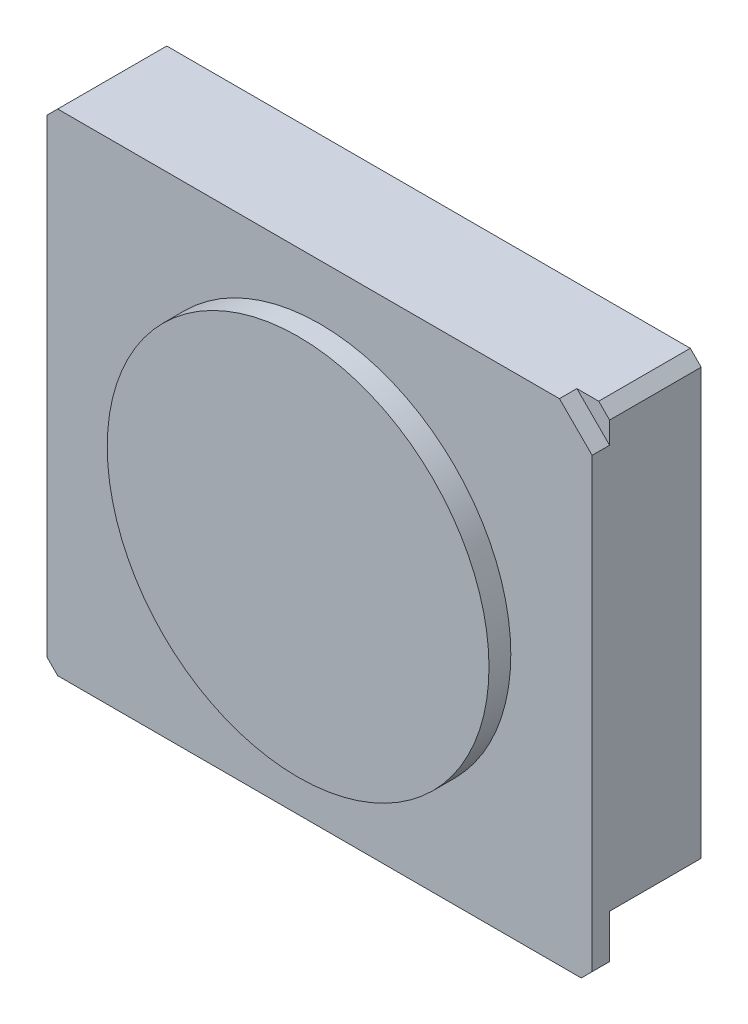
ISO-10303-21;
HEADER;
FILE_DESCRIPTION(('STEP AP214'),'2;1');
FILE_NAME('part.step','',(''),(''),'','','');
FILE_SCHEMA(('AUTOMOTIVE_DESIGN { 1 0 10303 214 1 1 1 1 }'));
ENDSEC;
DATA;
#1=APPLICATION_CONTEXT('core data for automotive mechanical design processes');
#2=APPLICATION_PROTOCOL_DEFINITION('international standard','automotive_design',2000,#1);
#3=PRODUCT_CONTEXT('',#1,'mechanical');
#4=PRODUCT('Part','Part','',(#3));
#5=PRODUCT_RELATED_PRODUCT_CATEGORY('part','',(#4));
#6=PRODUCT_DEFINITION_FORMATION('','',#4);
#7=PRODUCT_DEFINITION_CONTEXT('part definition',#1,'design');
#8=PRODUCT_DEFINITION('design','',#6,#7);
#9=PRODUCT_DEFINITION_SHAPE('','',#8);
#10=(LENGTH_UNIT() NAMED_UNIT(*) SI_UNIT(.MILLI.,.METRE.));
#11=(NAMED_UNIT(*) PLANE_ANGLE_UNIT() SI_UNIT($,.RADIAN.));
#12=(NAMED_UNIT(*) SI_UNIT($,.STERADIAN.) SOLID_ANGLE_UNIT());
#13=UNCERTAINTY_MEASURE_WITH_UNIT(LENGTH_MEASURE(1.E-05),#10,'distance_accuracy_value','');
#14=(GEOMETRIC_REPRESENTATION_CONTEXT(3) GLOBAL_UNCERTAINTY_ASSIGNED_CONTEXT((#13)) GLOBAL_UNIT_ASSIGNED_CONTEXT((#10,
#11,#12)) REPRESENTATION_CONTEXT('',''));
#15=CARTESIAN_POINT('',(0.,0.,0.));
#16=DIRECTION('',(0.,0.,1.));
#17=DIRECTION('',(1.,0.,0.));
#18=AXIS2_PLACEMENT_3D('',#15,#16,#17);
#19=CARTESIAN_POINT('',(0.,0.,-1.6));
#20=DIRECTION('',(0.,0.,-1.));
#21=DIRECTION('',(-1.,0.,0.));
#22=AXIS2_PLACEMENT_3D('',#19,#20,#21);
#23=PLANE('',#22);
#24=DIRECTION('',(0.,1.,0.));
#25=VECTOR('',#24,1.);
#26=CARTESIAN_POINT('',(24.9569707401033,-22.4612736660929,-1.6));
#27=LINE('',#26,#25);
#28=CARTESIAN_POINT('',(24.9569707401033,-21.4612736660929,-1.6));
#29=VERTEX_POINT('',#28);
#30=CARTESIAN_POINT('',(24.9569707401033,-17.4612736660929,-1.6));
#31=VERTEX_POINT('',#30);
#32=EDGE_CURVE('E320',#29,#31,#27,.T.);
#33=ORIENTED_EDGE('',*,*,#32,.F.);
#34=DIRECTION('',(0.707106781186545,0.70710678118655,0.));
#35=VECTOR('',#34,1.);
#36=CARTESIAN_POINT('',(23.2091222030982,-23.209122203098,-1.6));
#37=LINE('',#36,#35);
#38=CARTESIAN_POINT('',(23.9569707401033,-22.4612736660929,-1.6));
#39=VERTEX_POINT('',#38);
#40=EDGE_CURVE('E12',#29,#39,#37,.F.);
#41=ORIENTED_EDGE('',*,*,#40,.T.);
#42=DIRECTION('',(1.,0.,0.));
#43=VECTOR('',#42,1.);
#44=CARTESIAN_POINT('',(-25.0430292598967,-22.4612736660929,-1.6));
#45=LINE('',#44,#43);
#46=CARTESIAN_POINT('',(-15.5430292598967,-22.4612736660929,-1.6));
#47=VERTEX_POINT('',#46);
#48=EDGE_CURVE('E315',#47,#39,#45,.T.);
#49=ORIENTED_EDGE('',*,*,#48,.F.);
#50=DIRECTION('',(0.,-1.,0.));
#51=VECTOR('',#50,1.);
#52=CARTESIAN_POINT('',(-15.5430292598967,-21.4612736660929,-1.6));
#53=LINE('',#52,#51);
#54=CARTESIAN_POINT('',(-15.5430292598967,-21.4612736660929,-1.6));
#55=VERTEX_POINT('',#54);
#56=EDGE_CURVE('E635',#55,#47,#53,.T.);
#57=ORIENTED_EDGE('',*,*,#56,.F.);
#58=DIRECTION('',(1.,0.,0.));
#59=VECTOR('',#58,1.);
#60=CARTESIAN_POINT('',(-15.5430292598967,-21.4612736660929,-1.6));
#61=LINE('',#60,#59);
#62=CARTESIAN_POINT('',(-18.4430292598967,-21.4612736660929,-1.6));
#63=VERTEX_POINT('',#62);
#64=EDGE_CURVE('E206',#63,#55,#61,.T.);
#65=ORIENTED_EDGE('',*,*,#64,.F.);
#66=DIRECTION('',(0.,-1.,0.));
#67=VECTOR('',#66,1.);
#68=CARTESIAN_POINT('',(-18.4430292598967,0.,-1.6));
#69=LINE('',#68,#67);
#70=CARTESIAN_POINT('',(-18.4430292598967,-22.4612736660929,-1.6));
#71=VERTEX_POINT('',#70);
#72=EDGE_CURVE('E309',#63,#71,#69,.T.);
#73=ORIENTED_EDGE('',*,*,#72,.T.);
#74=CARTESIAN_POINT('',(-24.0430292598967,-22.4612736660929,-1.6));
#75=VERTEX_POINT('',#74);
#76=EDGE_CURVE('E317',#75,#71,#45,.T.);
#77=ORIENTED_EDGE('',*,*,#76,.F.);
#78=DIRECTION('',(0.70710678118655,-0.707106781186545,0.));
#79=VECTOR('',#78,1.);
#80=CARTESIAN_POINT('',(-23.2521514629948,-23.2521514629949,-1.6));
#81=LINE('',#80,#79);
#82=CARTESIAN_POINT('',(-25.0430292598967,-21.4612736660929,-1.6));
#83=VERTEX_POINT('',#82);
#84=EDGE_CURVE('E49',#75,#83,#81,.F.);
#85=ORIENTED_EDGE('',*,*,#84,.T.);
#86=DIRECTION('',(0.,-1.,0.));
#87=VECTOR('',#86,1.);
#88=CARTESIAN_POINT('',(-25.0430292598967,-22.4612736660929,-1.6));
#89=LINE('',#88,#87);
#90=CARTESIAN_POINT('',(-25.0430292598967,-17.4612736660929,-1.6));
#91=VERTEX_POINT('',#90);
#92=EDGE_CURVE('E311',#91,#83,#89,.T.);
#93=ORIENTED_EDGE('',*,*,#92,.F.);
#94=DIRECTION('',(-1.,0.,0.));
#95=VECTOR('',#94,1.);
#96=CARTESIAN_POINT('',(-25.0430292598967,-17.4612736660929,-1.6));
#97=LINE('',#96,#95);
#98=EDGE_CURVE('E273',#31,#91,#97,.T.);
#99=ORIENTED_EDGE('',*,*,#98,.F.);
#100=EDGE_LOOP('',(#33,#41,#49,#57,#65,#73,#77,#85,#93,#99));
#101=FACE_BOUND('',#100,.T.);
#102=ADVANCED_FACE('F40',(#101),#23,.T.);
#103=CARTESIAN_POINT('',(-25.0430292598967,-17.4612736660929,-10.));
#104=DIRECTION('',(0.,1.,0.));
#105=DIRECTION('',(-1.,0.,0.));
#106=AXIS2_PLACEMENT_3D('',#103,#104,#105);
#107=PLANE('',#106);
#108=ORIENTED_EDGE('',*,*,#98,.T.);
#109=DIRECTION('',(0.,0.,1.));
#110=VECTOR('',#109,1.);
#111=CARTESIAN_POINT('',(-25.0430292598967,-17.4612736660929,-10.));
#112=LINE('',#111,#110);
#113=CARTESIAN_POINT('',(-25.0430292598967,-17.4612736660929,-10.));
#114=VERTEX_POINT('',#113);
#115=EDGE_CURVE('E283',#114,#91,#112,.T.);
#116=ORIENTED_EDGE('',*,*,#115,.F.);
#117=DIRECTION('',(-1.,0.,0.));
#118=VECTOR('',#117,1.);
#119=CARTESIAN_POINT('',(-25.0430292598967,-17.4612736660929,-10.));
#120=LINE('',#119,#118);
#121=CARTESIAN_POINT('',(24.9569707401033,-17.4612736660929,-10.));
#122=VERTEX_POINT('',#121);
#123=EDGE_CURVE('E280',#122,#114,#120,.T.);
#124=ORIENTED_EDGE('',*,*,#123,.F.);
#125=DIRECTION('',(0.,0.,1.));
#126=VECTOR('',#125,1.);
#127=CARTESIAN_POINT('',(24.9569707401033,-17.4612736660929,-10.));
#128=LINE('',#127,#126);
#129=EDGE_CURVE('E296',#122,#31,#128,.T.);
#130=ORIENTED_EDGE('',*,*,#129,.T.);
#131=EDGE_LOOP('',(#108,#116,#124,#130));
#132=FACE_BOUND('',#131,.T.);
#133=CARTESIAN_POINT('',(-2.9,-17.4612736660929,-4.9));
#134=DIRECTION('',(0.,-1.,0.));
#135=DIRECTION('',(1.,0.,0.));
#136=AXIS2_PLACEMENT_3D('',#133,#134,#135);
#137=CIRCLE('',#136,1.6);
#138=CARTESIAN_POINT('',(-2.9,-17.4612736660929,-3.3));
#139=VERTEX_POINT('',#138);
#140=CARTESIAN_POINT('',(-2.9,-17.4612736660929,-6.5));
#141=VERTEX_POINT('',#140);
#142=EDGE_CURVE('E218',#139,#141,#137,.T.);
#143=ORIENTED_EDGE('',*,*,#142,.F.);
#144=DIRECTION('',(-1.,0.,0.));
#145=VECTOR('',#144,1.);
#146=CARTESIAN_POINT('',(-2.9,-17.4612736660929,-3.3));
#147=LINE('',#146,#145);
#148=CARTESIAN_POINT('',(2.9,-17.4612736660929,-3.3));
#149=VERTEX_POINT('',#148);
#150=EDGE_CURVE('E224',#149,#139,#147,.T.);
#151=ORIENTED_EDGE('',*,*,#150,.F.);
#152=CARTESIAN_POINT('',(2.9,-17.4612736660929,-4.9));
#153=DIRECTION('',(0.,-1.,0.));
#154=DIRECTION('',(1.,0.,0.));
#155=AXIS2_PLACEMENT_3D('',#152,#153,#154);
#156=CIRCLE('',#155,1.6);
#157=CARTESIAN_POINT('',(2.9,-17.4612736660929,-6.5));
#158=VERTEX_POINT('',#157);
#159=EDGE_CURVE('E230',#158,#149,#156,.T.);
#160=ORIENTED_EDGE('',*,*,#159,.F.);
#161=DIRECTION('',(1.,0.,0.));
#162=VECTOR('',#161,1.);
#163=CARTESIAN_POINT('',(-2.9,-17.4612736660929,-6.5));
#164=LINE('',#163,#162);
#165=EDGE_CURVE('E235',#141,#158,#164,.T.);
#166=ORIENTED_EDGE('',*,*,#165,.F.);
#167=EDGE_LOOP('',(#143,#151,#160,#166));
#168=FACE_BOUND('',#167,.T.);
#169=ADVANCED_FACE('F440',(#132,#168),#107,.F.);
#170=CARTESIAN_POINT('',(-25.0430292598967,-22.4612736660929,-1.6));
#171=DIRECTION('',(-1.,0.,0.));
#172=DIRECTION('',(0.,0.,1.));
#173=AXIS2_PLACEMENT_3D('',#170,#171,#172);
#174=PLANE('',#173);
#175=DIRECTION('',(0.,-1.,0.));
#176=VECTOR('',#175,1.);
#177=CARTESIAN_POINT('',(-25.0430292598967,-22.4612736660929,0.));
#178=LINE('',#177,#176);
#179=CARTESIAN_POINT('',(-25.0430292598967,21.538726333907,0.));
#180=VERTEX_POINT('',#179);
#181=CARTESIAN_POINT('',(-25.0430292598967,-21.4612736660929,0.));
#182=VERTEX_POINT('',#181);
#183=EDGE_CURVE('E304',#180,#182,#178,.T.);
#184=ORIENTED_EDGE('',*,*,#183,.F.);
#185=DIRECTION('',(0.,0.,-1.));
#186=VECTOR('',#185,1.);
#187=CARTESIAN_POINT('',(-25.0430292598967,21.538726333907,-1.6));
#188=LINE('',#187,#186);
#189=CARTESIAN_POINT('',(-25.0430292598967,21.538726333907,-10.));
#190=VERTEX_POINT('',#189);
#191=EDGE_CURVE('E374',#180,#190,#188,.T.);
#192=ORIENTED_EDGE('',*,*,#191,.T.);
#193=DIRECTION('',(0.,1.,0.));
#194=VECTOR('',#193,1.);
#195=CARTESIAN_POINT('',(-25.0430292598967,22.5387263339071,-10.));
#196=LINE('',#195,#194);
#197=EDGE_CURVE('E268',#114,#190,#196,.T.);
#198=ORIENTED_EDGE('',*,*,#197,.F.);
#199=ORIENTED_EDGE('',*,*,#115,.T.);
#200=ORIENTED_EDGE('',*,*,#92,.T.);
#201=DIRECTION('',(0.,0.,1.));
#202=VECTOR('',#201,1.);
#203=CARTESIAN_POINT('',(-25.0430292598967,-21.4612736660929,-1.6));
#204=LINE('',#203,#202);
#205=EDGE_CURVE('E370',#83,#182,#204,.T.);
#206=ORIENTED_EDGE('',*,*,#205,.T.);
#207=EDGE_LOOP('',(#184,#192,#198,#199,#200,#206));
#208=FACE_BOUND('',#207,.T.);
#209=ADVANCED_FACE('F405',(#208),#174,.T.);
#210=CARTESIAN_POINT('',(-25.0430292598967,22.5387263339071,-1.6));
#211=DIRECTION('',(0.,1.,0.));
#212=DIRECTION('',(0.,0.,1.));
#213=AXIS2_PLACEMENT_3D('',#210,#211,#212);
#214=PLANE('',#213);
#215=DIRECTION('',(1.,0.,0.));
#216=VECTOR('',#215,1.);
#217=CARTESIAN_POINT('',(-25.0430292598967,22.5387263339071,-10.));
#218=LINE('',#217,#216);
#219=CARTESIAN_POINT('',(-24.0430292598967,22.5387263339071,-10.));
#220=VERTEX_POINT('',#219);
#221=CARTESIAN_POINT('',(23.9569707401032,22.5387263339071,-10.));
#222=VERTEX_POINT('',#221);
#223=EDGE_CURVE('E272',#220,#222,#218,.T.);
#224=ORIENTED_EDGE('',*,*,#223,.F.);
#225=DIRECTION('',(0.,0.,1.));
#226=VECTOR('',#225,1.);
#227=CARTESIAN_POINT('',(-24.0430292598967,22.5387263339071,-1.6));
#228=LINE('',#227,#226);
#229=CARTESIAN_POINT('',(-24.0430292598967,22.5387263339071,0.));
#230=VERTEX_POINT('',#229);
#231=EDGE_CURVE('E357',#220,#230,#228,.T.);
#232=ORIENTED_EDGE('',*,*,#231,.T.);
#233=DIRECTION('',(-1.,0.,0.));
#234=VECTOR('',#233,1.);
#235=CARTESIAN_POINT('',(-25.0430292598967,22.5387263339071,0.));
#236=LINE('',#235,#234);
#237=CARTESIAN_POINT('',(21.9569707401033,22.5387263339071,0.));
#238=VERTEX_POINT('',#237);
#239=EDGE_CURVE('E316',#238,#230,#236,.T.);
#240=ORIENTED_EDGE('',*,*,#239,.F.);
#241=DIRECTION('',(0.,0.,1.));
#242=VECTOR('',#241,1.);
#243=CARTESIAN_POINT('',(21.9569707401033,22.5387263339071,-1.6));
#244=LINE('',#243,#242);
#245=CARTESIAN_POINT('',(21.9569707401033,22.5387263339071,-1.6));
#246=VERTEX_POINT('',#245);
#247=EDGE_CURVE('E310',#246,#238,#244,.T.);
#248=ORIENTED_EDGE('',*,*,#247,.F.);
#249=DIRECTION('',(1.,0.,0.));
#250=VECTOR('',#249,1.);
#251=CARTESIAN_POINT('',(-25.0430292598967,22.5387263339071,-1.6));
#252=LINE('',#251,#250);
#253=CARTESIAN_POINT('',(23.9569707401032,22.5387263339071,-1.6));
#254=VERTEX_POINT('',#253);
#255=EDGE_CURVE('E247',#246,#254,#252,.T.);
#256=ORIENTED_EDGE('',*,*,#255,.T.);
#257=DIRECTION('',(0.,0.,-1.));
#258=VECTOR('',#257,1.);
#259=CARTESIAN_POINT('',(23.9569707401032,22.5387263339071,-1.6));
#260=LINE('',#259,#258);
#261=EDGE_CURVE('E354',#254,#222,#260,.T.);
#262=ORIENTED_EDGE('',*,*,#261,.T.);
#263=EDGE_LOOP('',(#224,#232,#240,#248,#256,#262));
#264=FACE_BOUND('',#263,.T.);
#265=ADVANCED_FACE('F429',(#264),#214,.T.);
#266=CARTESIAN_POINT('',(21.9569707401033,22.5387263339071,-1.6));
#267=DIRECTION('',(0.707106781186548,0.707106781186548,0.));
#268=DIRECTION('',(-0.707106781186548,0.707106781186548,0.));
#269=AXIS2_PLACEMENT_3D('',#266,#267,#268);
#270=PLANE('',#269);
#271=DIRECTION('',(-0.707106781186548,0.707106781186548,0.));
#272=VECTOR('',#271,1.);
#273=CARTESIAN_POINT('',(21.9569707401033,22.5387263339071,0.));
#274=LINE('',#273,#272);
#275=CARTESIAN_POINT('',(24.9569707401033,19.5387263339071,0.));
#276=VERTEX_POINT('',#275);
#277=EDGE_CURVE('E339',#276,#238,#274,.T.);
#278=ORIENTED_EDGE('',*,*,#277,.F.);
#279=DIRECTION('',(0.,0.,1.));
#280=VECTOR('',#279,1.);
#281=CARTESIAN_POINT('',(24.9569707401033,19.5387263339071,-1.6));
#282=LINE('',#281,#280);
#283=CARTESIAN_POINT('',(24.9569707401033,19.5387263339071,-1.6));
#284=VERTEX_POINT('',#283);
#285=EDGE_CURVE('E328',#284,#276,#282,.T.);
#286=ORIENTED_EDGE('',*,*,#285,.F.);
#287=DIRECTION('',(-0.707106781186548,0.707106781186548,0.));
#288=VECTOR('',#287,1.);
#289=CARTESIAN_POINT('',(21.9569707401033,22.5387263339071,-1.6));
#290=LINE('',#289,#288);
#291=EDGE_CURVE('E324',#284,#246,#290,.T.);
#292=ORIENTED_EDGE('',*,*,#291,.T.);
#293=ORIENTED_EDGE('',*,*,#247,.T.);
#294=EDGE_LOOP('',(#278,#286,#292,#293));
#295=FACE_BOUND('',#294,.T.);
#296=ADVANCED_FACE('F425',(#295),#270,.T.);
#297=CARTESIAN_POINT('',(24.9569707401033,-22.4612736660929,-1.6));
#298=DIRECTION('',(1.,0.,0.));
#299=DIRECTION('',(0.,0.,-1.));
#300=AXIS2_PLACEMENT_3D('',#297,#298,#299);
#301=PLANE('',#300);
#302=DIRECTION('',(0.,-1.,0.));
#303=VECTOR('',#302,1.);
#304=CARTESIAN_POINT('',(24.9569707401033,22.5387263339071,-10.));
#305=LINE('',#304,#303);
#306=CARTESIAN_POINT('',(24.9569707401033,21.538726333907,-10.));
#307=VERTEX_POINT('',#306);
#308=EDGE_CURVE('E277',#307,#122,#305,.T.);
#309=ORIENTED_EDGE('',*,*,#308,.F.);
#310=DIRECTION('',(0.,0.,1.));
#311=VECTOR('',#310,1.);
#312=CARTESIAN_POINT('',(24.9569707401033,21.538726333907,-1.6));
#313=LINE('',#312,#311);
#314=CARTESIAN_POINT('',(24.9569707401033,21.538726333907,-1.6));
#315=VERTEX_POINT('',#314);
#316=EDGE_CURVE('E386',#307,#315,#313,.T.);
#317=ORIENTED_EDGE('',*,*,#316,.T.);
#318=DIRECTION('',(0.,-1.,0.));
#319=VECTOR('',#318,1.);
#320=CARTESIAN_POINT('',(24.9569707401033,22.5387263339071,-1.6));
#321=LINE('',#320,#319);
#322=EDGE_CURVE('E287',#315,#284,#321,.T.);
#323=ORIENTED_EDGE('',*,*,#322,.T.);
#324=ORIENTED_EDGE('',*,*,#285,.T.);
#325=DIRECTION('',(0.,1.,0.));
#326=VECTOR('',#325,1.);
#327=CARTESIAN_POINT('',(24.9569707401033,-22.4612736660929,0.));
#328=LINE('',#327,#326);
#329=CARTESIAN_POINT('',(24.9569707401033,-21.4612736660929,0.));
#330=VERTEX_POINT('',#329);
#331=EDGE_CURVE('E336',#330,#276,#328,.T.);
#332=ORIENTED_EDGE('',*,*,#331,.F.);
#333=DIRECTION('',(0.,0.,-1.));
#334=VECTOR('',#333,1.);
#335=CARTESIAN_POINT('',(24.9569707401033,-21.4612736660929,-1.6));
#336=LINE('',#335,#334);
#337=EDGE_CURVE('E383',#330,#29,#336,.T.);
#338=ORIENTED_EDGE('',*,*,#337,.T.);
#339=ORIENTED_EDGE('',*,*,#32,.T.);
#340=ORIENTED_EDGE('',*,*,#129,.F.);
#341=EDGE_LOOP('',(#309,#317,#323,#324,#332,#338,#339,#340));
#342=FACE_BOUND('',#341,.T.);
#343=ADVANCED_FACE('F419',(#342),#301,.T.);
#344=CARTESIAN_POINT('',(-25.0430292598967,-22.4612736660929,-1.6));
#345=DIRECTION('',(0.,-1.,0.));
#346=DIRECTION('',(0.,0.,-1.));
#347=AXIS2_PLACEMENT_3D('',#344,#345,#346);
#348=PLANE('',#347);
#349=ORIENTED_EDGE('',*,*,#48,.T.);
#350=DIRECTION('',(0.,0.,1.));
#351=VECTOR('',#350,1.);
#352=CARTESIAN_POINT('',(23.9569707401033,-22.4612736660929,-1.6));
#353=LINE('',#352,#351);
#354=CARTESIAN_POINT('',(23.9569707401033,-22.4612736660929,0.));
#355=VERTEX_POINT('',#354);
#356=EDGE_CURVE('E395',#39,#355,#353,.T.);
#357=ORIENTED_EDGE('',*,*,#356,.T.);
#358=DIRECTION('',(1.,0.,0.));
#359=VECTOR('',#358,1.);
#360=CARTESIAN_POINT('',(-25.0430292598967,-22.4612736660929,0.));
#361=LINE('',#360,#359);
#362=CARTESIAN_POINT('',(-24.0430292598967,-22.4612736660929,0.));
#363=VERTEX_POINT('',#362);
#364=EDGE_CURVE('E332',#363,#355,#361,.T.);
#365=ORIENTED_EDGE('',*,*,#364,.F.);
#366=DIRECTION('',(0.,0.,-1.));
#367=VECTOR('',#366,1.);
#368=CARTESIAN_POINT('',(-24.0430292598967,-22.4612736660929,-1.6));
#369=LINE('',#368,#367);
#370=EDGE_CURVE('E62',#363,#75,#369,.T.);
#371=ORIENTED_EDGE('',*,*,#370,.T.);
#372=ORIENTED_EDGE('',*,*,#76,.T.);
#373=EDGE_CURVE('E321',#71,#47,#45,.T.);
#374=ORIENTED_EDGE('',*,*,#373,.T.);
#375=EDGE_LOOP('',(#349,#357,#365,#371,#372,#374));
#376=FACE_BOUND('',#375,.T.);
#377=ADVANCED_FACE('F410',(#376),#348,.T.);
#378=CARTESIAN_POINT('',(0.,0.,0.));
#379=DIRECTION('',(0.,0.,-1.));
#380=DIRECTION('',(-1.,0.,0.));
#381=AXIS2_PLACEMENT_3D('',#378,#379,#380);
#382=PLANE('',#381);
#383=CARTESIAN_POINT('',(0.,0.,0.));
#384=DIRECTION('',(0.,0.,1.));
#385=DIRECTION('',(1.,0.,0.));
#386=AXIS2_PLACEMENT_3D('',#383,#384,#385);
#387=CIRCLE('',#386,17.5);
#388=CARTESIAN_POINT('',(17.5,0.,0.));
#389=VERTEX_POINT('',#388);
#390=EDGE_CURVE('E305',#389,#389,#387,.T.);
#391=ORIENTED_EDGE('',*,*,#390,.F.);
#392=EDGE_LOOP('',(#391));
#393=FACE_BOUND('',#392,.T.);
#394=ORIENTED_EDGE('',*,*,#239,.T.);
#395=DIRECTION('',(0.707106781186545,0.70710678118655,0.));
#396=VECTOR('',#395,1.);
#397=CARTESIAN_POINT('',(-24.0430292598967,22.5387263339071,0.));
#398=LINE('',#397,#396);
#399=EDGE_CURVE('E367',#230,#180,#398,.F.);
#400=ORIENTED_EDGE('',*,*,#399,.T.);
#401=ORIENTED_EDGE('',*,*,#183,.T.);
#402=DIRECTION('',(-0.70710678118655,0.707106781186545,0.));
#403=VECTOR('',#402,1.);
#404=CARTESIAN_POINT('',(-25.0430292598967,-21.4612736660929,0.));
#405=LINE('',#404,#403);
#406=EDGE_CURVE('E361',#182,#363,#405,.F.);
#407=ORIENTED_EDGE('',*,*,#406,.T.);
#408=ORIENTED_EDGE('',*,*,#364,.T.);
#409=DIRECTION('',(-0.707106781186545,-0.70710678118655,0.));
#410=VECTOR('',#409,1.);
#411=CARTESIAN_POINT('',(23.9569707401033,-22.4612736660929,0.));
#412=LINE('',#411,#410);
#413=EDGE_CURVE('E364',#355,#330,#412,.F.);
#414=ORIENTED_EDGE('',*,*,#413,.T.);
#415=ORIENTED_EDGE('',*,*,#331,.T.);
#416=ORIENTED_EDGE('',*,*,#277,.T.);
#417=EDGE_LOOP('',(#394,#400,#401,#407,#408,#414,#415,#416));
#418=FACE_BOUND('',#417,.T.);
#419=ADVANCED_FACE('F409',(#393,#418),#382,.F.);
#420=CARTESIAN_POINT('',(0.,0.,2.));
#421=DIRECTION('',(0.,0.,-1.));
#422=DIRECTION('',(-1.,0.,0.));
#423=AXIS2_PLACEMENT_3D('',#420,#421,#422);
#424=CYLINDRICAL_SURFACE('',#423,17.5);
#425=CARTESIAN_POINT('',(0.,0.,2.));
#426=DIRECTION('',(0.,0.,1.));
#427=DIRECTION('',(1.,0.,0.));
#428=AXIS2_PLACEMENT_3D('',#425,#426,#427);
#429=CIRCLE('',#428,17.5);
#430=CARTESIAN_POINT('',(17.5,0.,2.));
#431=VERTEX_POINT('',#430);
#432=EDGE_CURVE('E300',#431,#431,#429,.T.);
#433=ORIENTED_EDGE('',*,*,#432,.F.);
#434=EDGE_LOOP('',(#433));
#435=FACE_BOUND('',#434,.T.);
#436=ORIENTED_EDGE('',*,*,#390,.T.);
#437=EDGE_LOOP('',(#436));
#438=FACE_BOUND('',#437,.T.);
#439=ADVANCED_FACE('F460',(#435,#438),#424,.T.);
#440=CARTESIAN_POINT('',(0.,0.,2.));
#441=DIRECTION('',(0.,0.,1.));
#442=DIRECTION('',(1.,0.,0.));
#443=AXIS2_PLACEMENT_3D('',#440,#441,#442);
#444=PLANE('',#443);
#445=ORIENTED_EDGE('',*,*,#432,.T.);
#446=EDGE_LOOP('',(#445));
#447=FACE_BOUND('',#446,.T.);
#448=ADVANCED_FACE('F451',(#447),#444,.T.);
#449=CARTESIAN_POINT('',(0.,0.,-1.6));
#450=DIRECTION('',(0.,0.,1.));
#451=DIRECTION('',(1.,0.,0.));
#452=AXIS2_PLACEMENT_3D('',#449,#450,#451);
#453=PLANE('',#452);
#454=ORIENTED_EDGE('',*,*,#322,.F.);
#455=DIRECTION('',(0.70710678118655,-0.707106781186545,0.));
#456=VECTOR('',#455,1.);
#457=CARTESIAN_POINT('',(23.2478485370051,23.2478485370052,-1.6));
#458=LINE('',#457,#456);
#459=EDGE_CURVE('E390',#315,#254,#458,.F.);
#460=ORIENTED_EDGE('',*,*,#459,.T.);
#461=ORIENTED_EDGE('',*,*,#255,.F.);
#462=ORIENTED_EDGE('',*,*,#291,.F.);
#463=EDGE_LOOP('',(#454,#460,#461,#462));
#464=FACE_BOUND('',#463,.T.);
#465=ADVANCED_FACE('F449',(#464),#453,.T.);
#466=CARTESIAN_POINT('',(0.,0.,-10.));
#467=DIRECTION('',(0.,0.,1.));
#468=DIRECTION('',(1.,0.,0.));
#469=AXIS2_PLACEMENT_3D('',#466,#467,#468);
#470=PLANE('',#469);
#471=ORIENTED_EDGE('',*,*,#197,.T.);
#472=DIRECTION('',(-0.707106781186545,-0.70710678118655,0.));
#473=VECTOR('',#472,1.);
#474=CARTESIAN_POINT('',(-24.0430292598967,22.5387263339071,-10.));
#475=LINE('',#474,#473);
#476=EDGE_CURVE('E380',#190,#220,#475,.F.);
#477=ORIENTED_EDGE('',*,*,#476,.T.);
#478=ORIENTED_EDGE('',*,*,#223,.T.);
#479=DIRECTION('',(-0.70710678118655,0.707106781186545,0.));
#480=VECTOR('',#479,1.);
#481=CARTESIAN_POINT('',(24.9569707401033,21.538726333907,-10.));
#482=LINE('',#481,#480);
#483=EDGE_CURVE('E377',#222,#307,#482,.F.);
#484=ORIENTED_EDGE('',*,*,#483,.T.);
#485=ORIENTED_EDGE('',*,*,#308,.T.);
#486=ORIENTED_EDGE('',*,*,#123,.T.);
#487=EDGE_LOOP('',(#471,#477,#478,#484,#485,#486));
#488=FACE_BOUND('',#487,.T.);
#489=ADVANCED_FACE('F436',(#488),#470,.F.);
#490=CARTESIAN_POINT('',(-2.9,-32.6132368151006,-4.9));
#491=DIRECTION('',(0.,1.,0.));
#492=DIRECTION('',(-1.,0.,0.));
#493=AXIS2_PLACEMENT_3D('',#490,#491,#492);
#494=CYLINDRICAL_SURFACE('',#493,1.6);
#495=CARTESIAN_POINT('',(-2.9,-22.7612736660929,-4.9));
#496=DIRECTION('',(0.,-1.,0.));
#497=DIRECTION('',(0.,0.,-1.));
#498=AXIS2_PLACEMENT_3D('',#495,#496,#497);
#499=CIRCLE('',#498,1.6);
#500=CARTESIAN_POINT('',(-2.9,-22.7612736660929,-3.3));
#501=VERTEX_POINT('',#500);
#502=CARTESIAN_POINT('',(-2.9,-22.7612736660929,-6.5));
#503=VERTEX_POINT('',#502);
#504=EDGE_CURVE('E252',#501,#503,#499,.T.);
#505=ORIENTED_EDGE('',*,*,#504,.F.);
#506=DIRECTION('',(0.,1.,0.));
#507=VECTOR('',#506,1.);
#508=CARTESIAN_POINT('',(-2.9,-32.6132368151006,-3.3));
#509=LINE('',#508,#507);
#510=EDGE_CURVE('E213',#501,#139,#509,.T.);
#511=ORIENTED_EDGE('',*,*,#510,.T.);
#512=ORIENTED_EDGE('',*,*,#142,.T.);
#513=DIRECTION('',(0.,1.,0.));
#514=VECTOR('',#513,1.);
#515=CARTESIAN_POINT('',(-2.9,-32.6132368151006,-6.5));
#516=LINE('',#515,#514);
#517=EDGE_CURVE('E239',#503,#141,#516,.T.);
#518=ORIENTED_EDGE('',*,*,#517,.F.);
#519=EDGE_LOOP('',(#505,#511,#512,#518));
#520=FACE_BOUND('',#519,.T.);
#521=ADVANCED_FACE('F457',(#520),#494,.T.);
#522=CARTESIAN_POINT('',(-2.9,-32.6132368151006,-6.5));
#523=DIRECTION('',(0.,0.,1.));
#524=DIRECTION('',(1.,0.,0.));
#525=AXIS2_PLACEMENT_3D('',#522,#523,#524);
#526=PLANE('',#525);
#527=DIRECTION('',(1.,0.,0.));
#528=VECTOR('',#527,1.);
#529=CARTESIAN_POINT('',(-2.9,-22.7612736660929,-6.5));
#530=LINE('',#529,#528);
#531=CARTESIAN_POINT('',(2.9,-22.7612736660929,-6.5));
#532=VERTEX_POINT('',#531);
#533=EDGE_CURVE('E248',#503,#532,#530,.T.);
#534=ORIENTED_EDGE('',*,*,#533,.F.);
#535=ORIENTED_EDGE('',*,*,#517,.T.);
#536=ORIENTED_EDGE('',*,*,#165,.T.);
#537=DIRECTION('',(0.,1.,0.));
#538=VECTOR('',#537,1.);
#539=CARTESIAN_POINT('',(2.89999999999999,-32.6132368151006,-6.5));
#540=LINE('',#539,#538);
#541=EDGE_CURVE('E234',#532,#158,#540,.T.);
#542=ORIENTED_EDGE('',*,*,#541,.F.);
#543=EDGE_LOOP('',(#534,#535,#536,#542));
#544=FACE_BOUND('',#543,.T.);
#545=ADVANCED_FACE('F541',(#544),#526,.F.);
#546=CARTESIAN_POINT('',(2.89999999999999,-32.6132368151006,-4.9));
#547=DIRECTION('',(0.,1.,0.));
#548=DIRECTION('',(-1.,0.,0.));
#549=AXIS2_PLACEMENT_3D('',#546,#547,#548);
#550=CYLINDRICAL_SURFACE('',#549,1.6);
#551=CARTESIAN_POINT('',(2.9,-22.7612736660929,-4.9));
#552=DIRECTION('',(0.,-1.,0.));
#553=DIRECTION('',(0.,0.,-1.));
#554=AXIS2_PLACEMENT_3D('',#551,#552,#553);
#555=CIRCLE('',#554,1.6);
#556=CARTESIAN_POINT('',(2.9,-22.7612736660929,-3.3));
#557=VERTEX_POINT('',#556);
#558=EDGE_CURVE('E243',#532,#557,#555,.T.);
#559=ORIENTED_EDGE('',*,*,#558,.F.);
#560=ORIENTED_EDGE('',*,*,#541,.T.);
#561=ORIENTED_EDGE('',*,*,#159,.T.);
#562=DIRECTION('',(0.,1.,0.));
#563=VECTOR('',#562,1.);
#564=CARTESIAN_POINT('',(2.89999999999999,-32.6132368151006,-3.3));
#565=LINE('',#564,#563);
#566=EDGE_CURVE('E229',#557,#149,#565,.T.);
#567=ORIENTED_EDGE('',*,*,#566,.F.);
#568=EDGE_LOOP('',(#559,#560,#561,#567));
#569=FACE_BOUND('',#568,.T.);
#570=ADVANCED_FACE('F548',(#569),#550,.T.);
#571=CARTESIAN_POINT('',(-2.9,-32.6132368151006,-3.3));
#572=DIRECTION('',(0.,0.,-1.));
#573=DIRECTION('',(-1.,0.,0.));
#574=AXIS2_PLACEMENT_3D('',#571,#572,#573);
#575=PLANE('',#574);
#576=DIRECTION('',(-1.,0.,0.));
#577=VECTOR('',#576,1.);
#578=CARTESIAN_POINT('',(-2.9,-22.7612736660929,-3.3));
#579=LINE('',#578,#577);
#580=EDGE_CURVE('E228',#557,#501,#579,.T.);
#581=ORIENTED_EDGE('',*,*,#580,.F.);
#582=ORIENTED_EDGE('',*,*,#566,.T.);
#583=ORIENTED_EDGE('',*,*,#150,.T.);
#584=ORIENTED_EDGE('',*,*,#510,.F.);
#585=EDGE_LOOP('',(#581,#582,#583,#584));
#586=FACE_BOUND('',#585,.T.);
#587=ADVANCED_FACE('F556',(#586),#575,.F.);
#588=CARTESIAN_POINT('',(-25.0430292598967,-22.7612736660929,-1.6));
#589=DIRECTION('',(0.,-1.,0.));
#590=DIRECTION('',(0.,0.,-1.));
#591=AXIS2_PLACEMENT_3D('',#588,#589,#590);
#592=PLANE('',#591);
#593=ORIENTED_EDGE('',*,*,#580,.T.);
#594=ORIENTED_EDGE('',*,*,#504,.T.);
#595=ORIENTED_EDGE('',*,*,#533,.T.);
#596=ORIENTED_EDGE('',*,*,#558,.T.);
#597=EDGE_LOOP('',(#593,#594,#595,#596));
#598=FACE_BOUND('',#597,.T.);
#599=ADVANCED_FACE('F564',(#598),#592,.T.);
#600=CARTESIAN_POINT('',(-15.5430292598967,-21.4612736660929,-3.1));
#601=DIRECTION('',(-1.,0.,0.));
#602=DIRECTION('',(0.,-1.,0.));
#603=AXIS2_PLACEMENT_3D('',#600,#601,#602);
#604=PLANE('',#603);
#605=ORIENTED_EDGE('',*,*,#56,.T.);
#606=CARTESIAN_POINT('',(-15.5430292598967,-23.4612736660929,-1.6));
#607=VERTEX_POINT('',#606);
#608=EDGE_CURVE('E210',#47,#607,#53,.T.);
#609=ORIENTED_EDGE('',*,*,#608,.T.);
#610=DIRECTION('',(0.,0.,1.));
#611=VECTOR('',#610,1.);
#612=CARTESIAN_POINT('',(-15.5430292598967,-23.4612736660929,-3.1));
#613=LINE('',#612,#611);
#614=CARTESIAN_POINT('',(-15.5430292598967,-23.4612736660929,-3.1));
#615=VERTEX_POINT('',#614);
#616=EDGE_CURVE('E189',#615,#607,#613,.T.);
#617=ORIENTED_EDGE('',*,*,#616,.F.);
#618=DIRECTION('',(0.,-1.,0.));
#619=VECTOR('',#618,1.);
#620=CARTESIAN_POINT('',(-15.5430292598967,-21.4612736660929,-3.1));
#621=LINE('',#620,#619);
#622=CARTESIAN_POINT('',(-15.5430292598967,-21.4612736660929,-3.1));
#623=VERTEX_POINT('',#622);
#624=EDGE_CURVE('E196',#623,#615,#621,.T.);
#625=ORIENTED_EDGE('',*,*,#624,.F.);
#626=DIRECTION('',(0.,0.,1.));
#627=VECTOR('',#626,1.);
#628=CARTESIAN_POINT('',(-15.5430292598967,-21.4612736660929,-3.1));
#629=LINE('',#628,#627);
#630=EDGE_CURVE('E640',#623,#55,#629,.T.);
#631=ORIENTED_EDGE('',*,*,#630,.T.);
#632=EDGE_LOOP('',(#605,#609,#617,#625,#631));
#633=FACE_BOUND('',#632,.T.);
#634=ADVANCED_FACE('F209',(#633),#604,.F.);
#635=CARTESIAN_POINT('',(-15.5430292598967,-23.4612736660929,-3.1));
#636=DIRECTION('',(0.,1.,0.));
#637=DIRECTION('',(0.,0.,1.));
#638=AXIS2_PLACEMENT_3D('',#635,#636,#637);
#639=PLANE('',#638);
#640=DIRECTION('',(-1.,0.,0.));
#641=VECTOR('',#640,1.);
#642=CARTESIAN_POINT('',(-15.5430292598967,-23.4612736660929,-1.6));
#643=LINE('',#642,#641);
#644=CARTESIAN_POINT('',(-18.4430292598967,-23.4612736660929,-1.6));
#645=VERTEX_POINT('',#644);
#646=EDGE_CURVE('E632',#607,#645,#643,.T.);
#647=ORIENTED_EDGE('',*,*,#646,.T.);
#648=DIRECTION('',(0.,0.,1.));
#649=VECTOR('',#648,1.);
#650=CARTESIAN_POINT('',(-18.4430292598967,-23.4612736660929,-3.1));
#651=LINE('',#650,#649);
#652=CARTESIAN_POINT('',(-18.4430292598967,-23.4612736660929,-3.1));
#653=VERTEX_POINT('',#652);
#654=EDGE_CURVE('E191',#653,#645,#651,.T.);
#655=ORIENTED_EDGE('',*,*,#654,.F.);
#656=DIRECTION('',(-1.,0.,0.));
#657=VECTOR('',#656,1.);
#658=CARTESIAN_POINT('',(-15.5430292598967,-23.4612736660929,-3.1));
#659=LINE('',#658,#657);
#660=EDGE_CURVE('E185',#615,#653,#659,.T.);
#661=ORIENTED_EDGE('',*,*,#660,.F.);
#662=ORIENTED_EDGE('',*,*,#616,.T.);
#663=EDGE_LOOP('',(#647,#655,#661,#662));
#664=FACE_BOUND('',#663,.T.);
#665=ADVANCED_FACE('F187',(#664),#639,.F.);
#666=CARTESIAN_POINT('',(-18.4430292598967,-21.4612736660929,-3.1));
#667=DIRECTION('',(1.,0.,0.));
#668=DIRECTION('',(0.,0.,-1.));
#669=AXIS2_PLACEMENT_3D('',#666,#667,#668);
#670=PLANE('',#669);
#671=DIRECTION('',(0.,1.,0.));
#672=VECTOR('',#671,1.);
#673=CARTESIAN_POINT('',(-18.4430292598967,-21.4612736660929,-1.6));
#674=LINE('',#673,#672);
#675=EDGE_CURVE('E626',#645,#71,#674,.T.);
#676=ORIENTED_EDGE('',*,*,#675,.T.);
#677=ORIENTED_EDGE('',*,*,#72,.F.);
#678=DIRECTION('',(0.,0.,1.));
#679=VECTOR('',#678,1.);
#680=CARTESIAN_POINT('',(-18.4430292598967,-21.4612736660929,-3.1));
#681=LINE('',#680,#679);
#682=CARTESIAN_POINT('',(-18.4430292598967,-21.4612736660929,-3.1));
#683=VERTEX_POINT('',#682);
#684=EDGE_CURVE('E220',#683,#63,#681,.T.);
#685=ORIENTED_EDGE('',*,*,#684,.F.);
#686=DIRECTION('',(0.,1.,0.));
#687=VECTOR('',#686,1.);
#688=CARTESIAN_POINT('',(-18.4430292598967,-21.4612736660929,-3.1));
#689=LINE('',#688,#687);
#690=EDGE_CURVE('E195',#653,#683,#689,.T.);
#691=ORIENTED_EDGE('',*,*,#690,.F.);
#692=ORIENTED_EDGE('',*,*,#654,.T.);
#693=EDGE_LOOP('',(#676,#677,#685,#691,#692));
#694=FACE_BOUND('',#693,.T.);
#695=ADVANCED_FACE('F583',(#694),#670,.F.);
#696=CARTESIAN_POINT('',(-15.5430292598967,-21.4612736660929,-3.1));
#697=DIRECTION('',(0.,-1.,0.));
#698=DIRECTION('',(0.,0.,-1.));
#699=AXIS2_PLACEMENT_3D('',#696,#697,#698);
#700=PLANE('',#699);
#701=ORIENTED_EDGE('',*,*,#64,.T.);
#702=ORIENTED_EDGE('',*,*,#630,.F.);
#703=DIRECTION('',(1.,0.,0.));
#704=VECTOR('',#703,1.);
#705=CARTESIAN_POINT('',(-15.5430292598967,-21.4612736660929,-3.1));
#706=LINE('',#705,#704);
#707=EDGE_CURVE('E201',#683,#623,#706,.T.);
#708=ORIENTED_EDGE('',*,*,#707,.F.);
#709=ORIENTED_EDGE('',*,*,#684,.T.);
#710=EDGE_LOOP('',(#701,#702,#708,#709));
#711=FACE_BOUND('',#710,.T.);
#712=ADVANCED_FACE('F590',(#711),#700,.F.);
#713=CARTESIAN_POINT('',(0.,0.,-3.1));
#714=DIRECTION('',(0.,0.,-1.));
#715=DIRECTION('',(-1.,0.,0.));
#716=AXIS2_PLACEMENT_3D('',#713,#714,#715);
#717=PLANE('',#716);
#718=ORIENTED_EDGE('',*,*,#624,.T.);
#719=ORIENTED_EDGE('',*,*,#660,.T.);
#720=ORIENTED_EDGE('',*,*,#690,.T.);
#721=ORIENTED_EDGE('',*,*,#707,.T.);
#722=EDGE_LOOP('',(#718,#719,#720,#721));
#723=FACE_BOUND('',#722,.T.);
#724=ADVANCED_FACE('F199',(#723),#717,.T.);
#725=CARTESIAN_POINT('',(0.,0.,-1.6));
#726=DIRECTION('',(0.,0.,-1.));
#727=DIRECTION('',(-1.,0.,0.));
#728=AXIS2_PLACEMENT_3D('',#725,#726,#727);
#729=PLANE('',#728);
#730=ORIENTED_EDGE('',*,*,#373,.F.);
#731=ORIENTED_EDGE('',*,*,#675,.F.);
#732=ORIENTED_EDGE('',*,*,#646,.F.);
#733=ORIENTED_EDGE('',*,*,#608,.F.);
#734=EDGE_LOOP('',(#730,#731,#732,#733));
#735=FACE_BOUND('',#734,.T.);
#736=ADVANCED_FACE('F486',(#735),#729,.F.);
#737=CARTESIAN_POINT('',(-24.0430292598967,22.5387263339071,-1.6));
#738=DIRECTION('',(0.70710678118655,-0.707106781186545,0.));
#739=DIRECTION('',(0.,0.,1.));
#740=AXIS2_PLACEMENT_3D('',#737,#738,#739);
#741=PLANE('',#740);
#742=ORIENTED_EDGE('',*,*,#476,.F.);
#743=ORIENTED_EDGE('',*,*,#191,.F.);
#744=ORIENTED_EDGE('',*,*,#399,.F.);
#745=ORIENTED_EDGE('',*,*,#231,.F.);
#746=EDGE_LOOP('',(#742,#743,#744,#745));
#747=FACE_BOUND('',#746,.T.);
#748=ADVANCED_FACE('F433',(#747),#741,.F.);
#749=CARTESIAN_POINT('',(24.9569707401033,21.538726333907,-1.6));
#750=DIRECTION('',(-0.707106781186545,-0.70710678118655,0.));
#751=DIRECTION('',(0.,0.,1.));
#752=AXIS2_PLACEMENT_3D('',#749,#750,#751);
#753=PLANE('',#752);
#754=ORIENTED_EDGE('',*,*,#483,.F.);
#755=ORIENTED_EDGE('',*,*,#261,.F.);
#756=ORIENTED_EDGE('',*,*,#459,.F.);
#757=ORIENTED_EDGE('',*,*,#316,.F.);
#758=EDGE_LOOP('',(#754,#755,#756,#757));
#759=FACE_BOUND('',#758,.T.);
#760=ADVANCED_FACE('F445',(#759),#753,.F.);
#761=CARTESIAN_POINT('',(23.9569707401033,-22.4612736660929,-1.6));
#762=DIRECTION('',(-0.70710678118655,0.707106781186545,0.));
#763=DIRECTION('',(0.,0.,1.));
#764=AXIS2_PLACEMENT_3D('',#761,#762,#763);
#765=PLANE('',#764);
#766=ORIENTED_EDGE('',*,*,#40,.F.);
#767=ORIENTED_EDGE('',*,*,#337,.F.);
#768=ORIENTED_EDGE('',*,*,#413,.F.);
#769=ORIENTED_EDGE('',*,*,#356,.F.);
#770=EDGE_LOOP('',(#766,#767,#768,#769));
#771=FACE_BOUND('',#770,.T.);
#772=ADVANCED_FACE('F414',(#771),#765,.F.);
#773=CARTESIAN_POINT('',(-25.0430292598967,-21.4612736660929,-1.6));
#774=DIRECTION('',(0.707106781186545,0.70710678118655,0.));
#775=DIRECTION('',(0.,0.,1.));
#776=AXIS2_PLACEMENT_3D('',#773,#774,#775);
#777=PLANE('',#776);
#778=ORIENTED_EDGE('',*,*,#84,.F.);
#779=ORIENTED_EDGE('',*,*,#370,.F.);
#780=ORIENTED_EDGE('',*,*,#406,.F.);
#781=ORIENTED_EDGE('',*,*,#205,.F.);
#782=EDGE_LOOP('',(#778,#779,#780,#781));
#783=FACE_BOUND('',#782,.T.);
#784=ADVANCED_FACE('F42',(#783),#777,.F.);
#785=CLOSED_SHELL('',(#102,#169,#209,#265,#296,#343,#377,#419,#439,#448,#465,#489,#521,#545,
#570,#587,#599,#634,#665,#695,#712,#724,#736,#748,#760,#772,#784));
#786=MANIFOLD_SOLID_BREP('B2',#785);
#787=ADVANCED_BREP_SHAPE_REPRESENTATION('',(#18,#786),#14);
#788=SHAPE_DEFINITION_REPRESENTATION(#9,#787);
ENDSEC;
END-ISO-10303-21;
